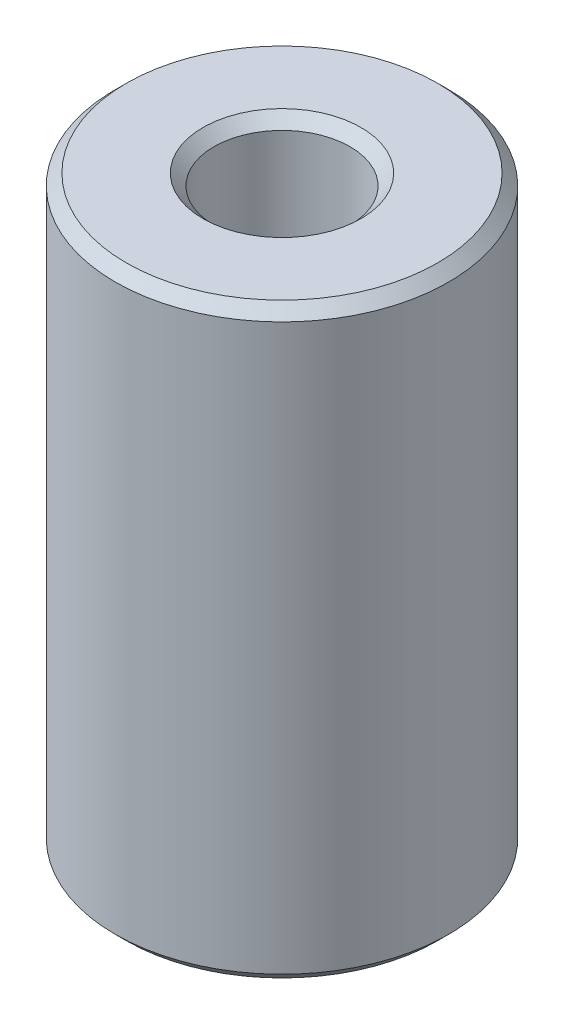
ISO-10303-21;
HEADER;
FILE_DESCRIPTION(('STEP AP214'),'2;1');
FILE_NAME('part.step','',(''),(''),'','','');
FILE_SCHEMA(('AUTOMOTIVE_DESIGN { 1 0 10303 214 1 1 1 1 }'));
ENDSEC;
DATA;
#1=APPLICATION_CONTEXT('core data for automotive mechanical design processes');
#2=APPLICATION_PROTOCOL_DEFINITION('international standard','automotive_design',2000,#1);
#3=PRODUCT_CONTEXT('',#1,'mechanical');
#4=PRODUCT('Part','Part','',(#3));
#5=PRODUCT_RELATED_PRODUCT_CATEGORY('part','',(#4));
#6=PRODUCT_DEFINITION_FORMATION('','',#4);
#7=PRODUCT_DEFINITION_CONTEXT('part definition',#1,'design');
#8=PRODUCT_DEFINITION('design','',#6,#7);
#9=PRODUCT_DEFINITION_SHAPE('','',#8);
#10=(LENGTH_UNIT() NAMED_UNIT(*) SI_UNIT(.MILLI.,.METRE.));
#11=(NAMED_UNIT(*) PLANE_ANGLE_UNIT() SI_UNIT($,.RADIAN.));
#12=(NAMED_UNIT(*) SI_UNIT($,.STERADIAN.) SOLID_ANGLE_UNIT());
#13=UNCERTAINTY_MEASURE_WITH_UNIT(LENGTH_MEASURE(1.E-05),#10,'distance_accuracy_value','');
#14=(GEOMETRIC_REPRESENTATION_CONTEXT(3) GLOBAL_UNCERTAINTY_ASSIGNED_CONTEXT((#13)) GLOBAL_UNIT_ASSIGNED_CONTEXT((#10,
#11,#12)) REPRESENTATION_CONTEXT('',''));
#15=CARTESIAN_POINT('',(0.,0.,0.));
#16=DIRECTION('',(0.,0.,1.));
#17=DIRECTION('',(1.,0.,0.));
#18=AXIS2_PLACEMENT_3D('',#15,#16,#17);
#19=CARTESIAN_POINT('',(0.,193.689420812268,0.));
#20=DIRECTION('',(0.,-1.,0.));
#21=DIRECTION('',(0.,0.,-1.));
#22=AXIS2_PLACEMENT_3D('',#19,#20,#21);
#23=CYLINDRICAL_SURFACE('',#22,55.);
#24=CARTESIAN_POINT('',(0.,3.6487018255297,0.));
#25=DIRECTION('',(0.,1.,0.));
#26=DIRECTION('',(0.,0.,1.));
#27=AXIS2_PLACEMENT_3D('',#24,#25,#26);
#28=CIRCLE('',#27,55.);
#29=CARTESIAN_POINT('',(0.,3.6487018255297,55.));
#30=VERTEX_POINT('',#29);
#31=EDGE_CURVE('E10',#30,#30,#28,.T.);
#32=ORIENTED_EDGE('',*,*,#31,.T.);
#33=EDGE_LOOP('',(#32));
#34=FACE_BOUND('',#33,.T.);
#35=CARTESIAN_POINT('',(0.,190.040718986739,0.));
#36=DIRECTION('',(0.,1.,0.));
#37=DIRECTION('',(0.,0.,1.));
#38=AXIS2_PLACEMENT_3D('',#35,#36,#37);
#39=CIRCLE('',#38,55.);
#40=CARTESIAN_POINT('',(0.,190.040718986739,55.));
#41=VERTEX_POINT('',#40);
#42=EDGE_CURVE('E50',#41,#41,#39,.F.);
#43=ORIENTED_EDGE('',*,*,#42,.T.);
#44=EDGE_LOOP('',(#43));
#45=FACE_BOUND('',#44,.T.);
#46=ADVANCED_FACE('F39',(#34,#45),#23,.T.);
#47=CARTESIAN_POINT('',(0.,193.689420812268,0.));
#48=DIRECTION('',(0.,1.,0.));
#49=DIRECTION('',(0.,0.,1.));
#50=AXIS2_PLACEMENT_3D('',#47,#48,#49);
#51=PLANE('',#50);
#52=CARTESIAN_POINT('',(0.,193.689420812268,0.));
#53=DIRECTION('',(0.,1.,0.));
#54=DIRECTION('',(0.,0.,1.));
#55=AXIS2_PLACEMENT_3D('',#52,#53,#54);
#56=CIRCLE('',#55,26.068072601471);
#57=CARTESIAN_POINT('',(0.,193.689420812268,26.068072601471));
#58=VERTEX_POINT('',#57);
#59=EDGE_CURVE('E58',#58,#58,#56,.F.);
#60=ORIENTED_EDGE('',*,*,#59,.T.);
#61=EDGE_LOOP('',(#60));
#62=FACE_BOUND('',#61,.T.);
#63=CARTESIAN_POINT('',(0.,193.689420812268,0.));
#64=DIRECTION('',(0.,1.,0.));
#65=DIRECTION('',(0.,0.,1.));
#66=AXIS2_PLACEMENT_3D('',#63,#64,#65);
#67=CIRCLE('',#66,51.3512981744704);
#68=CARTESIAN_POINT('',(0.,193.689420812268,51.3512981744704));
#69=VERTEX_POINT('',#68);
#70=EDGE_CURVE('E61',#69,#69,#67,.T.);
#71=ORIENTED_EDGE('',*,*,#70,.T.);
#72=EDGE_LOOP('',(#71));
#73=FACE_BOUND('',#72,.T.);
#74=ADVANCED_FACE('F88',(#62,#73),#51,.T.);
#75=CARTESIAN_POINT('',(0.,0.,0.));
#76=DIRECTION('',(0.,1.,0.));
#77=DIRECTION('',(0.,0.,1.));
#78=AXIS2_PLACEMENT_3D('',#75,#76,#77);
#79=PLANE('',#78);
#80=CARTESIAN_POINT('',(0.,0.,0.));
#81=DIRECTION('',(0.,1.,0.));
#82=DIRECTION('',(0.,0.,1.));
#83=AXIS2_PLACEMENT_3D('',#80,#81,#82);
#84=CIRCLE('',#83,26.0680726014709);
#85=CARTESIAN_POINT('',(0.,0.,-26.0680726014709));
#86=VERTEX_POINT('',#85);
#87=EDGE_CURVE('E51',#86,#86,#84,.T.);
#88=ORIENTED_EDGE('',*,*,#87,.T.);
#89=EDGE_LOOP('',(#88));
#90=FACE_BOUND('',#89,.T.);
#91=CARTESIAN_POINT('',(0.,0.,0.));
#92=DIRECTION('',(0.,1.,0.));
#93=DIRECTION('',(0.,0.,1.));
#94=AXIS2_PLACEMENT_3D('',#91,#92,#93);
#95=CIRCLE('',#94,51.3512981744703);
#96=CARTESIAN_POINT('',(0.,0.,51.3512981744703));
#97=VERTEX_POINT('',#96);
#98=EDGE_CURVE('E54',#97,#97,#95,.F.);
#99=ORIENTED_EDGE('',*,*,#98,.T.);
#100=EDGE_LOOP('',(#99));
#101=FACE_BOUND('',#100,.T.);
#102=ADVANCED_FACE('F83',(#90,#101),#79,.F.);
#103=CARTESIAN_POINT('',(0.,193.689420812268,0.));
#104=DIRECTION('',(0.,-1.,0.));
#105=DIRECTION('',(0.,0.,-1.));
#106=AXIS2_PLACEMENT_3D('',#103,#104,#105);
#107=CYLINDRICAL_SURFACE('',#106,22.4193707759413);
#108=CARTESIAN_POINT('',(0.,190.040718986738,0.));
#109=DIRECTION('',(0.,1.,0.));
#110=DIRECTION('',(0.,0.,1.));
#111=AXIS2_PLACEMENT_3D('',#108,#109,#110);
#112=CIRCLE('',#111,22.4193707759413);
#113=CARTESIAN_POINT('',(0.,190.040718986738,-22.4193707759413));
#114=VERTEX_POINT('',#113);
#115=EDGE_CURVE('E67',#114,#114,#112,.T.);
#116=CARTESIAN_POINT('',(0.,3.6487018255297,0.));
#117=DIRECTION('',(0.,1.,0.));
#118=DIRECTION('',(0.,0.,1.));
#119=AXIS2_PLACEMENT_3D('',#116,#117,#118);
#120=CIRCLE('',#119,22.4193707759413);
#121=CARTESIAN_POINT('',(0.,3.64870182552968,-22.4193707759413));
#122=VERTEX_POINT('',#121);
#123=EDGE_CURVE('E69',#122,#122,#120,.F.);
#124=CARTESIAN_POINT('',(0.,190.040718986738,-22.4193707759413));
#125=CARTESIAN_POINT('',(0.,188.099135474643,-22.4193707759413));
#126=CARTESIAN_POINT('',(0.,186.157551962547,-22.4193707759413));
#127=CARTESIAN_POINT('',(0.,182.274384938355,-22.4193707759413));
#128=CARTESIAN_POINT('',(0.,180.332801426259,-22.4193707759413));
#129=CARTESIAN_POINT('',(0.,176.449634402067,-22.4193707759413));
#130=CARTESIAN_POINT('',(0.,174.508050889971,-22.4193707759413));
#131=CARTESIAN_POINT('',(0.,170.624883865779,-22.4193707759413));
#132=CARTESIAN_POINT('',(0.,168.683300353683,-22.4193707759413));
#133=CARTESIAN_POINT('',(0.,164.800133329491,-22.4193707759413));
#134=CARTESIAN_POINT('',(0.,162.858549817396,-22.4193707759413));
#135=CARTESIAN_POINT('',(0.,158.975382793204,-22.4193707759413));
#136=CARTESIAN_POINT('',(0.,157.033799281108,-22.4193707759413));
#137=CARTESIAN_POINT('',(0.,153.150632256916,-22.4193707759413));
#138=CARTESIAN_POINT('',(0.,151.20904874482,-22.4193707759413));
#139=CARTESIAN_POINT('',(0.,147.325881720628,-22.4193707759413));
#140=CARTESIAN_POINT('',(0.,145.384298208532,-22.4193707759413));
#141=CARTESIAN_POINT('',(0.,141.50113118434,-22.4193707759413));
#142=CARTESIAN_POINT('',(0.,139.559547672244,-22.4193707759413));
#143=CARTESIAN_POINT('',(0.,135.676380648053,-22.4193707759413));
#144=CARTESIAN_POINT('',(0.,133.734797135957,-22.4193707759413));
#145=CARTESIAN_POINT('',(0.,129.851630111765,-22.4193707759413));
#146=CARTESIAN_POINT('',(0.,127.910046599669,-22.4193707759413));
#147=CARTESIAN_POINT('',(0.,124.026879575477,-22.4193707759413));
#148=CARTESIAN_POINT('',(0.,122.085296063381,-22.4193707759413));
#149=CARTESIAN_POINT('',(0.,118.202129039189,-22.4193707759413));
#150=CARTESIAN_POINT('',(0.,116.260545527093,-22.4193707759413));
#151=CARTESIAN_POINT('',(0.,112.377378502901,-22.4193707759413));
#152=CARTESIAN_POINT('',(0.,110.435794990806,-22.4193707759413));
#153=CARTESIAN_POINT('',(0.,106.552627966614,-22.4193707759413));
#154=CARTESIAN_POINT('',(0.,104.611044454518,-22.4193707759413));
#155=CARTESIAN_POINT('',(0.,100.727877430326,-22.4193707759413));
#156=CARTESIAN_POINT('',(0.,98.78629391823,-22.4193707759413));
#157=CARTESIAN_POINT('',(0.,94.9031268940382,-22.4193707759413));
#158=CARTESIAN_POINT('',(0.,92.9615433819422,-22.4193707759413));
#159=CARTESIAN_POINT('',(0.,89.0783763577504,-22.4193707759413));
#160=CARTESIAN_POINT('',(0.,87.1367928456545,-22.4193707759413));
#161=CARTESIAN_POINT('',(0.,83.2536258214626,-22.4193707759413));
#162=CARTESIAN_POINT('',(0.,81.3120423093667,-22.4193707759413));
#163=CARTESIAN_POINT('',(0.,77.4288752851748,-22.4193707759413));
#164=CARTESIAN_POINT('',(0.,75.4872917730789,-22.4193707759413));
#165=CARTESIAN_POINT('',(0.,71.6041247488871,-22.4193707759413));
#166=CARTESIAN_POINT('',(0.,69.6625412367911,-22.4193707759413));
#167=CARTESIAN_POINT('',(0.,65.7793742125993,-22.4193707759413));
#168=CARTESIAN_POINT('',(0.,63.8377907005034,-22.4193707759413));
#169=CARTESIAN_POINT('',(0.,59.9546236763115,-22.4193707759413));
#170=CARTESIAN_POINT('',(0.,58.0130401642156,-22.4193707759413));
#171=CARTESIAN_POINT('',(0.,54.1298731400237,-22.4193707759413));
#172=CARTESIAN_POINT('',(0.,52.1882896279278,-22.4193707759413));
#173=CARTESIAN_POINT('',(0.,48.3051226037359,-22.4193707759413));
#174=CARTESIAN_POINT('',(0.,46.36353909164,-22.4193707759413));
#175=CARTESIAN_POINT('',(0.,42.4803720674482,-22.4193707759413));
#176=CARTESIAN_POINT('',(0.,40.5387885553522,-22.4193707759413));
#177=CARTESIAN_POINT('',(0.,36.6556215311604,-22.4193707759413));
#178=CARTESIAN_POINT('',(0.,34.7140380190645,-22.4193707759413));
#179=CARTESIAN_POINT('',(0.,30.8308709948727,-22.4193707759413));
#180=CARTESIAN_POINT('',(0.,28.8892874827767,-22.4193707759413));
#181=CARTESIAN_POINT('',(0.,25.0061204585849,-22.4193707759413));
#182=CARTESIAN_POINT('',(0.,23.0645369464889,-22.4193707759413));
#183=CARTESIAN_POINT('',(0.,19.1813699222971,-22.4193707759413));
#184=CARTESIAN_POINT('',(0.,17.2397864102012,-22.4193707759413));
#185=CARTESIAN_POINT('',(0.,13.3566193860093,-22.4193707759413));
#186=CARTESIAN_POINT('',(0.,11.4150358739134,-22.4193707759413));
#187=CARTESIAN_POINT('',(0.,7.53186884972153,-22.4193707759413));
#188=CARTESIAN_POINT('',(0.,5.5902853376256,-22.4193707759413));
#189=CARTESIAN_POINT('',(0.,3.64870182552968,-22.4193707759413));
#190=B_SPLINE_CURVE_WITH_KNOTS('',3,(#124,#125,#126,#127,#128,#129,#130,#131,#132,#133,#134,
#135,#136,#137,#138,#139,#140,#141,#142,#143,#144,#145,#146,#147,#148,#149,#150,#151,#152,#153,
#154,#155,#156,#157,#158,#159,#160,#161,#162,#163,#164,#165,#166,#167,#168,#169,#170,#171,#172,
#173,#174,#175,#176,#177,#178,#179,#180,#181,#182,#183,#184,#185,#186,#187,#188,#189),
.UNSPECIFIED.,.F.,.F.,(4,2,2,2,2,2,2,2,2,2,2,2,2,2,2,2,2,2,2,2,2,2,2,2,2,2,2,2,2,2,2,2,4),(0.,
5.82475053628775,11.6495010725755,17.4742516088633,23.2990021451511,29.1237526814389,
34.9485032177266,40.7732537540144,46.5980042903022,52.42275482659,58.2475053628777,
64.0722558991655,69.8970064354533,75.7217569717411,81.5465075080288,87.3712580443166,
93.1960085806044,99.0207591168922,104.84550965318,110.670260189468,116.495010725755,
122.319761262043,128.144511798331,133.969262334619,139.794012870907,145.618763407194,
151.443513943482,157.26826447977,163.093015016058,168.917765552345,174.742516088633,
180.567266624921,186.392017161209),.UNSPECIFIED.);
#191=EDGE_CURVE('BSEAM71',#114,#122,#190,.T.);
#192=ORIENTED_EDGE('',*,*,#115,.T.);
#193=ORIENTED_EDGE('',*,*,#123,.T.);
#194=ORIENTED_EDGE('',*,*,#191,.T.);
#195=ORIENTED_EDGE('',*,*,#191,.F.);
#196=EDGE_LOOP('',(#192,#194,#193,#195));
#197=FACE_BOUND('',#196,.T.);
#198=ADVANCED_FACE('F71',(#197),#107,.F.);
#199=CARTESIAN_POINT('',(0.,190.040718986738,0.));
#200=DIRECTION('',(0.,1.,0.));
#201=DIRECTION('',(0.,0.,1.));
#202=AXIS2_PLACEMENT_3D('',#199,#200,#201);
#203=CONICAL_SURFACE('',#202,22.4193707759413,0.785398163397447);
#204=ORIENTED_EDGE('',*,*,#59,.F.);
#205=EDGE_LOOP('',(#204));
#206=FACE_BOUND('',#205,.T.);
#207=ORIENTED_EDGE('',*,*,#115,.F.);
#208=EDGE_LOOP('',(#207));
#209=FACE_BOUND('',#208,.T.);
#210=ADVANCED_FACE('F77',(#206,#209),#203,.F.);
#211=CARTESIAN_POINT('',(0.,0.,0.));
#212=DIRECTION('',(0.,-1.,0.));
#213=DIRECTION('',(0.,0.,-1.));
#214=AXIS2_PLACEMENT_3D('',#211,#212,#213);
#215=CONICAL_SURFACE('',#214,26.0680726014709,0.785398163397444);
#216=CARTESIAN_POINT('',(0.,3.6487018255297,-22.4193707759413));
#217=CARTESIAN_POINT('',(0.,3.6106945148471,-22.4573780866239));
#218=CARTESIAN_POINT('',(0.,3.5726872041645,-22.4953853973065));
#219=CARTESIAN_POINT('',(0.,3.4966725827993,-22.5714000186717));
#220=CARTESIAN_POINT('',(0.,3.4586652721167,-22.6094073293543));
#221=CARTESIAN_POINT('',(0.,3.3826506507515,-22.6854219507195));
#222=CARTESIAN_POINT('',(0.,3.3446433400689,-22.7234292614021));
#223=CARTESIAN_POINT('',(0.,3.26862871870369,-22.7994438827673));
#224=CARTESIAN_POINT('',(0.,3.23062140802109,-22.8374511934499));
#225=CARTESIAN_POINT('',(0.,3.15460678665589,-22.9134658148151));
#226=CARTESIAN_POINT('',(0.,3.11659947597329,-22.9514731254977));
#227=CARTESIAN_POINT('',(0.,3.04058485460809,-23.0274877468629));
#228=CARTESIAN_POINT('',(0.,3.00257754392549,-23.0654950575455));
#229=CARTESIAN_POINT('',(0.,2.92656292256028,-23.1415096789107));
#230=CARTESIAN_POINT('',(0.,2.88855561187768,-23.1795169895933));
#231=CARTESIAN_POINT('',(0.,2.81254099051248,-23.2555316109585));
#232=CARTESIAN_POINT('',(0.,2.77453367982988,-23.2935389216411));
#233=CARTESIAN_POINT('',(0.,2.69851905846468,-23.3695535430063));
#234=CARTESIAN_POINT('',(0.,2.66051174778208,-23.4075608536889));
#235=CARTESIAN_POINT('',(0.,2.58449712641687,-23.4835754750541));
#236=CARTESIAN_POINT('',(0.,2.54648981573427,-23.5215827857367));
#237=CARTESIAN_POINT('',(0.,2.47047519436907,-23.5975974071019));
#238=CARTESIAN_POINT('',(0.,2.43246788368647,-23.6356047177845));
#239=CARTESIAN_POINT('',(0.,2.35645326232127,-23.7116193391497));
#240=CARTESIAN_POINT('',(0.,2.31844595163867,-23.7496266498323));
#241=CARTESIAN_POINT('',(0.,2.24243133027346,-23.8256412711975));
#242=CARTESIAN_POINT('',(0.,2.20442401959086,-23.8636485818801));
#243=CARTESIAN_POINT('',(0.,2.12840939822566,-23.9396632032453));
#244=CARTESIAN_POINT('',(0.,2.09040208754306,-23.9776705139279));
#245=CARTESIAN_POINT('',(0.,2.01438746617786,-24.0536851352931));
#246=CARTESIAN_POINT('',(0.,1.97638015549526,-24.0916924459757));
#247=CARTESIAN_POINT('',(0.,1.90036553413005,-24.1677070673409));
#248=CARTESIAN_POINT('',(0.,1.86235822344745,-24.2057143780235));
#249=CARTESIAN_POINT('',(0.,1.78634360208225,-24.2817289993887));
#250=CARTESIAN_POINT('',(0.,1.74833629139965,-24.3197363100713));
#251=CARTESIAN_POINT('',(0.,1.67232167003445,-24.3957509314365));
#252=CARTESIAN_POINT('',(0.,1.63431435935185,-24.4337582421191));
#253=CARTESIAN_POINT('',(0.,1.55829973798664,-24.5097728634843));
#254=CARTESIAN_POINT('',(0.,1.52029242730404,-24.5477801741669));
#255=CARTESIAN_POINT('',(0.,1.44427780593884,-24.6237947955321));
#256=CARTESIAN_POINT('',(0.,1.40627049525624,-24.6618021062147));
#257=CARTESIAN_POINT('',(0.,1.33025587389104,-24.7378167275799));
#258=CARTESIAN_POINT('',(0.,1.29224856320844,-24.7758240382625));
#259=CARTESIAN_POINT('',(0.,1.21623394184323,-24.8518386596277));
#260=CARTESIAN_POINT('',(0.,1.17822663116063,-24.8898459703103));
#261=CARTESIAN_POINT('',(0.,1.10221200979543,-24.9658605916755));
#262=CARTESIAN_POINT('',(0.,1.06420469911283,-25.0038679023581));
#263=CARTESIAN_POINT('',(0.,0.988190077747628,-25.0798825237233));
#264=CARTESIAN_POINT('',(0.,0.950182767065027,-25.1178898344059));
#265=CARTESIAN_POINT('',(0.,0.874168145699824,-25.1939044557711));
#266=CARTESIAN_POINT('',(0.,0.836160835017224,-25.2319117664537));
#267=CARTESIAN_POINT('',(0.,0.760146213652022,-25.3079263878189));
#268=CARTESIAN_POINT('',(0.,0.722138902969421,-25.3459336985015));
#269=CARTESIAN_POINT('',(0.,0.646124281604218,-25.4219483198667));
#270=CARTESIAN_POINT('',(0.,0.608116970921617,-25.4599556305493));
#271=CARTESIAN_POINT('',(0.,0.532102349556415,-25.5359702519145));
#272=CARTESIAN_POINT('',(0.,0.494095038873814,-25.5739775625971));
#273=CARTESIAN_POINT('',(0.,0.418080417508612,-25.6499921839623));
#274=CARTESIAN_POINT('',(0.,0.380073106826011,-25.6879994946449));
#275=CARTESIAN_POINT('',(0.,0.304058485460809,-25.7640141160101));
#276=CARTESIAN_POINT('',(0.,0.266051174778208,-25.8020214266927));
#277=CARTESIAN_POINT('',(0.,0.190036553413005,-25.8780360480579));
#278=CARTESIAN_POINT('',(0.,0.152029242730404,-25.9160433587405));
#279=CARTESIAN_POINT('',(0.,0.0760146213652022,-25.9920579801057));
#280=CARTESIAN_POINT('',(0.,0.0380073106826011,-26.0300652907883));
#281=CARTESIAN_POINT('',(0.,0.,-26.0680726014709));
#282=B_SPLINE_CURVE_WITH_KNOTS('',3,(#216,#217,#218,#219,#220,#221,#222,#223,#224,#225,#226,
#227,#228,#229,#230,#231,#232,#233,#234,#235,#236,#237,#238,#239,#240,#241,#242,#243,#244,#245,
#246,#247,#248,#249,#250,#251,#252,#253,#254,#255,#256,#257,#258,#259,#260,#261,#262,#263,#264,
#265,#266,#267,#268,#269,#270,#271,#272,#273,#274,#275,#276,#277,#278,#279,#280,#281),
.UNSPECIFIED.,.F.,.F.,(4,2,2,2,2,2,2,2,2,2,2,2,2,2,2,2,2,2,2,2,2,2,2,2,2,2,2,2,2,2,2,2,4),(0.,
0.161251362709986,0.322502725419972,0.483754088129959,0.645005450839945,0.806256813549931,
0.967508176259917,1.1287595389699,1.29001090167989,1.45126226438987,1.61251362709986,
1.77376498980985,1.93501635251983,2.09626771522982,2.2575190779398,2.41877044064979,
2.58002180335978,2.74127316606976,2.90252452877975,3.06377589148973,3.22502725419972,
3.38627861690971,3.54752997961969,3.70878134232968,3.87003270503966,4.03128406774965,
4.19253543045963,4.35378679316962,4.51503815587961,4.67628951858959,4.83754088129958,
4.99879224400957,5.16004360671955),.UNSPECIFIED.);
#283=EDGE_CURVE('BSEAM73',#122,#86,#282,.T.);
#284=ORIENTED_EDGE('',*,*,#123,.F.);
#285=ORIENTED_EDGE('',*,*,#87,.F.);
#286=ORIENTED_EDGE('',*,*,#283,.T.);
#287=ORIENTED_EDGE('',*,*,#283,.F.);
#288=EDGE_LOOP('',(#284,#286,#285,#287));
#289=FACE_BOUND('',#288,.T.);
#290=ADVANCED_FACE('F73',(#289),#215,.F.);
#291=CARTESIAN_POINT('',(0.,3.6487018255297,0.));
#292=DIRECTION('',(0.,1.,0.));
#293=DIRECTION('',(0.,0.,1.));
#294=AXIS2_PLACEMENT_3D('',#291,#292,#293);
#295=CONICAL_SURFACE('',#294,55.,0.785398163397451);
#296=CARTESIAN_POINT('',(0.,0.,51.3512981744703));
#297=CARTESIAN_POINT('',(0.,0.0380073106825989,51.3893054851529));
#298=CARTESIAN_POINT('',(0.,0.0760146213652006,51.4273127958355));
#299=CARTESIAN_POINT('',(0.,0.152029242730404,51.5033274172007));
#300=CARTESIAN_POINT('',(0.,0.190036553413006,51.5413347278833));
#301=CARTESIAN_POINT('',(0.,0.266051174778208,51.6173493492485));
#302=CARTESIAN_POINT('',(0.,0.304058485460808,51.6553566599311));
#303=CARTESIAN_POINT('',(0.,0.38007310682601,51.7313712812963));
#304=CARTESIAN_POINT('',(0.,0.418080417508612,51.7693785919789));
#305=CARTESIAN_POINT('',(0.,0.494095038873814,51.8453932133441));
#306=CARTESIAN_POINT('',(0.,0.532102349556414,51.8834005240267));
#307=CARTESIAN_POINT('',(0.,0.608116970921617,51.9594151453919));
#308=CARTESIAN_POINT('',(0.,0.646124281604218,51.9974224560745));
#309=CARTESIAN_POINT('',(0.,0.722138902969421,52.0734370774397));
#310=CARTESIAN_POINT('',(0.,0.760146213652022,52.1114443881223));
#311=CARTESIAN_POINT('',(0.,0.836160835017223,52.1874590094875));
#312=CARTESIAN_POINT('',(0.,0.874168145699824,52.2254663201701));
#313=CARTESIAN_POINT('',(0.,0.950182767065026,52.3014809415353));
#314=CARTESIAN_POINT('',(0.,0.988190077747628,52.3394882522179));
#315=CARTESIAN_POINT('',(0.,1.06420469911283,52.4155028735831));
#316=CARTESIAN_POINT('',(0.,1.10221200979543,52.4535101842657));
#317=CARTESIAN_POINT('',(0.,1.17822663116063,52.5295248056309));
#318=CARTESIAN_POINT('',(0.,1.21623394184323,52.5675321163135));
#319=CARTESIAN_POINT('',(0.,1.29224856320844,52.6435467376787));
#320=CARTESIAN_POINT('',(0.,1.33025587389104,52.6815540483613));
#321=CARTESIAN_POINT('',(0.,1.40627049525624,52.7575686697265));
#322=CARTESIAN_POINT('',(0.,1.44427780593884,52.7955759804091));
#323=CARTESIAN_POINT('',(0.,1.52029242730404,52.8715906017743));
#324=CARTESIAN_POINT('',(0.,1.55829973798664,52.9095979124569));
#325=CARTESIAN_POINT('',(0.,1.63431435935185,52.9856125338221));
#326=CARTESIAN_POINT('',(0.,1.67232167003445,53.0236198445047));
#327=CARTESIAN_POINT('',(0.,1.74833629139965,53.0996344658699));
#328=CARTESIAN_POINT('',(0.,1.78634360208225,53.1376417765525));
#329=CARTESIAN_POINT('',(0.,1.86235822344745,53.2136563979177));
#330=CARTESIAN_POINT('',(0.,1.90036553413005,53.2516637086003));
#331=CARTESIAN_POINT('',(0.,1.97638015549526,53.3276783299655));
#332=CARTESIAN_POINT('',(0.,2.01438746617786,53.3656856406481));
#333=CARTESIAN_POINT('',(0.,2.09040208754306,53.4417002620133));
#334=CARTESIAN_POINT('',(0.,2.12840939822566,53.479707572696));
#335=CARTESIAN_POINT('',(0.,2.20442401959086,53.5557221940611));
#336=CARTESIAN_POINT('',(0.,2.24243133027346,53.5937295047438));
#337=CARTESIAN_POINT('',(0.,2.31844595163867,53.669744126109));
#338=CARTESIAN_POINT('',(0.,2.35645326232127,53.7077514367916));
#339=CARTESIAN_POINT('',(0.,2.43246788368647,53.7837660581568));
#340=CARTESIAN_POINT('',(0.,2.47047519436907,53.8217733688394));
#341=CARTESIAN_POINT('',(0.,2.54648981573427,53.8977879902046));
#342=CARTESIAN_POINT('',(0.,2.58449712641687,53.9357953008872));
#343=CARTESIAN_POINT('',(0.,2.66051174778208,54.0118099222524));
#344=CARTESIAN_POINT('',(0.,2.69851905846468,54.049817232935));
#345=CARTESIAN_POINT('',(0.,2.77453367982988,54.1258318543002));
#346=CARTESIAN_POINT('',(0.,2.81254099051248,54.1638391649828));
#347=CARTESIAN_POINT('',(0.,2.88855561187768,54.239853786348));
#348=CARTESIAN_POINT('',(0.,2.92656292256028,54.2778610970306));
#349=CARTESIAN_POINT('',(0.,3.00257754392549,54.3538757183958));
#350=CARTESIAN_POINT('',(0.,3.04058485460809,54.3918830290784));
#351=CARTESIAN_POINT('',(0.,3.11659947597329,54.4678976504436));
#352=CARTESIAN_POINT('',(0.,3.15460678665589,54.5059049611262));
#353=CARTESIAN_POINT('',(0.,3.23062140802109,54.5819195824914));
#354=CARTESIAN_POINT('',(0.,3.26862871870369,54.619926893174));
#355=CARTESIAN_POINT('',(0.,3.34464334006889,54.6959415145392));
#356=CARTESIAN_POINT('',(0.,3.3826506507515,54.7339488252218));
#357=CARTESIAN_POINT('',(0.,3.4586652721167,54.809963446587));
#358=CARTESIAN_POINT('',(0.,3.4966725827993,54.8479707572696));
#359=CARTESIAN_POINT('',(0.,3.5726872041645,54.9239853786348));
#360=CARTESIAN_POINT('',(0.,3.6106945148471,54.9619926893174));
#361=CARTESIAN_POINT('',(0.,3.6487018255297,55.));
#362=B_SPLINE_CURVE_WITH_KNOTS('',3,(#296,#297,#298,#299,#300,#301,#302,#303,#304,#305,#306,
#307,#308,#309,#310,#311,#312,#313,#314,#315,#316,#317,#318,#319,#320,#321,#322,#323,#324,#325,
#326,#327,#328,#329,#330,#331,#332,#333,#334,#335,#336,#337,#338,#339,#340,#341,#342,#343,#344,
#345,#346,#347,#348,#349,#350,#351,#352,#353,#354,#355,#356,#357,#358,#359,#360,#361),
.UNSPECIFIED.,.F.,.F.,(4,2,2,2,2,2,2,2,2,2,2,2,2,2,2,2,2,2,2,2,2,2,2,2,2,2,2,2,2,2,2,2,4),(0.,
0.161251362709989,0.322502725419972,0.483754088129961,0.64500545083995,0.806256813549938,
0.967508176259922,1.12875953896991,1.2900109016799,1.45126226438988,1.61251362709987,
1.77376498980986,1.93501635251985,2.09626771522983,2.25751907793982,2.41877044064981,
2.58002180335979,2.74127316606978,2.90252452877977,3.06377589148976,3.22502725419974,
3.38627861690973,3.54752997961972,3.70878134232971,3.87003270503969,4.03128406774968,
4.19253543045967,4.35378679316965,4.51503815587964,4.67628951858963,4.83754088129962,
4.99879224400961,5.1600436067196),.UNSPECIFIED.);
#363=EDGE_CURVE('BSEAM76',#97,#30,#362,.T.);
#364=ORIENTED_EDGE('',*,*,#98,.F.);
#365=ORIENTED_EDGE('',*,*,#31,.F.);
#366=ORIENTED_EDGE('',*,*,#363,.T.);
#367=ORIENTED_EDGE('',*,*,#363,.F.);
#368=EDGE_LOOP('',(#364,#366,#365,#367));
#369=FACE_BOUND('',#368,.T.);
#370=ADVANCED_FACE('F76',(#369),#295,.T.);
#371=CARTESIAN_POINT('',(0.,193.689420812268,0.));
#372=DIRECTION('',(0.,-1.,0.));
#373=DIRECTION('',(0.,0.,-1.));
#374=AXIS2_PLACEMENT_3D('',#371,#372,#373);
#375=CONICAL_SURFACE('',#374,51.3512981744704,0.785398163397446);
#376=ORIENTED_EDGE('',*,*,#42,.F.);
#377=EDGE_LOOP('',(#376));
#378=FACE_BOUND('',#377,.T.);
#379=ORIENTED_EDGE('',*,*,#70,.F.);
#380=EDGE_LOOP('',(#379));
#381=FACE_BOUND('',#380,.T.);
#382=ADVANCED_FACE('F45',(#378,#381),#375,.T.);
#383=CLOSED_SHELL('',(#46,#74,#102,#198,#210,#290,#370,#382));
#384=MANIFOLD_SOLID_BREP('B2',#383);
#385=ADVANCED_BREP_SHAPE_REPRESENTATION('',(#18,#384),#14);
#386=SHAPE_DEFINITION_REPRESENTATION(#9,#385);
ENDSEC;
END-ISO-10303-21;
